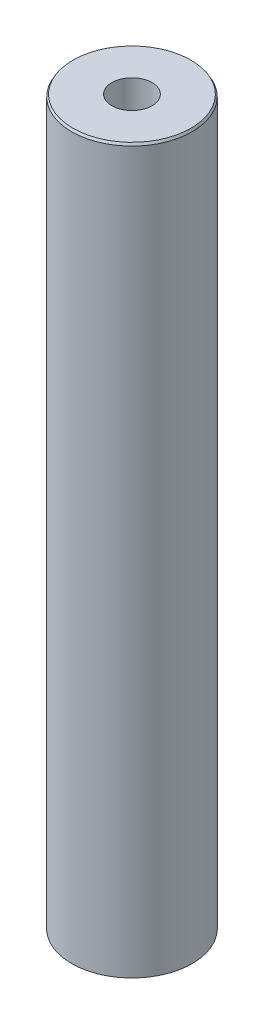
ISO-10303-21;
HEADER;
FILE_DESCRIPTION(('STEP AP214'),'2;1');
FILE_NAME('part.step','',(''),(''),'','','');
FILE_SCHEMA(('AUTOMOTIVE_DESIGN { 1 0 10303 214 1 1 1 1 }'));
ENDSEC;
DATA;
#1=APPLICATION_CONTEXT('core data for automotive mechanical design processes');
#2=APPLICATION_PROTOCOL_DEFINITION('international standard','automotive_design',2000,#1);
#3=PRODUCT_CONTEXT('',#1,'mechanical');
#4=PRODUCT('Part','Part','',(#3));
#5=PRODUCT_RELATED_PRODUCT_CATEGORY('part','',(#4));
#6=PRODUCT_DEFINITION_FORMATION('','',#4);
#7=PRODUCT_DEFINITION_CONTEXT('part definition',#1,'design');
#8=PRODUCT_DEFINITION('design','',#6,#7);
#9=PRODUCT_DEFINITION_SHAPE('','',#8);
#10=(LENGTH_UNIT() NAMED_UNIT(*) SI_UNIT(.MILLI.,.METRE.));
#11=(NAMED_UNIT(*) PLANE_ANGLE_UNIT() SI_UNIT($,.RADIAN.));
#12=(NAMED_UNIT(*) SI_UNIT($,.STERADIAN.) SOLID_ANGLE_UNIT());
#13=UNCERTAINTY_MEASURE_WITH_UNIT(LENGTH_MEASURE(1.E-05),#10,'distance_accuracy_value','');
#14=(GEOMETRIC_REPRESENTATION_CONTEXT(3) GLOBAL_UNCERTAINTY_ASSIGNED_CONTEXT((#13)) GLOBAL_UNIT_ASSIGNED_CONTEXT((#10,
#11,#12)) REPRESENTATION_CONTEXT('',''));
#15=CARTESIAN_POINT('',(0.,0.,0.));
#16=DIRECTION('',(0.,0.,1.));
#17=DIRECTION('',(1.,0.,0.));
#18=AXIS2_PLACEMENT_3D('',#15,#16,#17);
#19=CARTESIAN_POINT('',(0.,600.,0.));
#20=DIRECTION('',(0.,-1.,0.));
#21=DIRECTION('',(0.,0.,-1.));
#22=AXIS2_PLACEMENT_3D('',#19,#20,#21);
#23=CYLINDRICAL_SURFACE('',#22,50.);
#24=CARTESIAN_POINT('',(0.,598.070283497979,0.));
#25=DIRECTION('',(0.,1.,0.));
#26=DIRECTION('',(0.,0.,1.));
#27=AXIS2_PLACEMENT_3D('',#24,#25,#26);
#28=CIRCLE('',#27,50.);
#29=CARTESIAN_POINT('',(0.,598.070283497979,50.));
#30=VERTEX_POINT('',#29);
#31=EDGE_CURVE('E50',#30,#30,#28,.F.);
#32=ORIENTED_EDGE('',*,*,#31,.T.);
#33=EDGE_LOOP('',(#32));
#34=FACE_BOUND('',#33,.T.);
#35=CARTESIAN_POINT('',(0.,1.11412234190111,0.));
#36=DIRECTION('',(0.,1.,0.));
#37=DIRECTION('',(0.,0.,1.));
#38=AXIS2_PLACEMENT_3D('',#35,#36,#37);
#39=CIRCLE('',#38,50.);
#40=CARTESIAN_POINT('',(0.,1.11412234190111,50.));
#41=VERTEX_POINT('',#40);
#42=EDGE_CURVE('E51',#41,#41,#39,.T.);
#43=ORIENTED_EDGE('',*,*,#42,.T.);
#44=EDGE_LOOP('',(#43));
#45=FACE_BOUND('',#44,.T.);
#46=ADVANCED_FACE('F39',(#34,#45),#23,.T.);
#47=CARTESIAN_POINT('',(0.,600.,0.));
#48=DIRECTION('',(0.,1.,0.));
#49=DIRECTION('',(0.,0.,1.));
#50=AXIS2_PLACEMENT_3D('',#47,#48,#49);
#51=PLANE('',#50);
#52=CARTESIAN_POINT('',(0.,600.,0.));
#53=DIRECTION('',(0.,1.,0.));
#54=DIRECTION('',(0.,0.,1.));
#55=AXIS2_PLACEMENT_3D('',#52,#53,#54);
#56=CIRCLE('',#55,48.8858776580987);
#57=CARTESIAN_POINT('',(0.,600.,48.8858776580987));
#58=VERTEX_POINT('',#57);
#59=EDGE_CURVE('E54',#58,#58,#56,.T.);
#60=ORIENTED_EDGE('',*,*,#59,.T.);
#61=EDGE_LOOP('',(#60));
#62=FACE_BOUND('',#61,.T.);
#63=CARTESIAN_POINT('',(0.,600.,0.));
#64=DIRECTION('',(0.,1.,0.));
#65=DIRECTION('',(0.,0.,1.));
#66=AXIS2_PLACEMENT_3D('',#63,#64,#65);
#67=CIRCLE('',#66,16.6505416189368);
#68=CARTESIAN_POINT('',(0.,600.,16.6505416189368));
#69=VERTEX_POINT('',#68);
#70=EDGE_CURVE('E58',#69,#69,#67,.T.);
#71=ORIENTED_EDGE('',*,*,#70,.F.);
#72=EDGE_LOOP('',(#71));
#73=FACE_BOUND('',#72,.T.);
#74=ADVANCED_FACE('F69',(#62,#73),#51,.T.);
#75=CARTESIAN_POINT('',(0.,0.,0.));
#76=DIRECTION('',(0.,1.,0.));
#77=DIRECTION('',(0.,0.,1.));
#78=AXIS2_PLACEMENT_3D('',#75,#76,#77);
#79=PLANE('',#78);
#80=CARTESIAN_POINT('',(0.,0.,0.));
#81=DIRECTION('',(0.,1.,0.));
#82=DIRECTION('',(0.,0.,1.));
#83=AXIS2_PLACEMENT_3D('',#80,#81,#82);
#84=CIRCLE('',#83,48.0702834979797);
#85=CARTESIAN_POINT('',(0.,0.,48.0702834979797));
#86=VERTEX_POINT('',#85);
#87=EDGE_CURVE('E10',#86,#86,#84,.F.);
#88=ORIENTED_EDGE('',*,*,#87,.T.);
#89=EDGE_LOOP('',(#88));
#90=FACE_BOUND('',#89,.T.);
#91=CARTESIAN_POINT('',(0.,0.,0.));
#92=DIRECTION('',(0.,1.,0.));
#93=DIRECTION('',(0.,0.,1.));
#94=AXIS2_PLACEMENT_3D('',#91,#92,#93);
#95=CIRCLE('',#94,16.6505416189368);
#96=CARTESIAN_POINT('',(0.,0.,16.6505416189368));
#97=VERTEX_POINT('',#96);
#98=EDGE_CURVE('E63',#97,#97,#95,.T.);
#99=ORIENTED_EDGE('',*,*,#98,.T.);
#100=EDGE_LOOP('',(#99));
#101=FACE_BOUND('',#100,.T.);
#102=ADVANCED_FACE('F75',(#90,#101),#79,.F.);
#103=CARTESIAN_POINT('',(0.,600.,0.));
#104=DIRECTION('',(0.,-1.,0.));
#105=DIRECTION('',(0.,0.,-1.));
#106=AXIS2_PLACEMENT_3D('',#103,#104,#105);
#107=CYLINDRICAL_SURFACE('',#106,16.6505416189368);
#108=ORIENTED_EDGE('',*,*,#70,.T.);
#109=EDGE_LOOP('',(#108));
#110=FACE_BOUND('',#109,.T.);
#111=ORIENTED_EDGE('',*,*,#98,.F.);
#112=EDGE_LOOP('',(#111));
#113=FACE_BOUND('',#112,.T.);
#114=ADVANCED_FACE('F70',(#110,#113),#107,.F.);
#115=CARTESIAN_POINT('',(0.,600.,0.));
#116=DIRECTION('',(0.,-1.,0.));
#117=DIRECTION('',(0.,0.,-1.));
#118=AXIS2_PLACEMENT_3D('',#115,#116,#117);
#119=CONICAL_SURFACE('',#118,48.8858776580987,0.523598775598272);
#120=ORIENTED_EDGE('',*,*,#31,.F.);
#121=EDGE_LOOP('',(#120));
#122=FACE_BOUND('',#121,.T.);
#123=ORIENTED_EDGE('',*,*,#59,.F.);
#124=EDGE_LOOP('',(#123));
#125=FACE_BOUND('',#124,.T.);
#126=ADVANCED_FACE('F81',(#122,#125),#119,.T.);
#127=CARTESIAN_POINT('',(0.,1.11412234190111,0.));
#128=DIRECTION('',(0.,1.,0.));
#129=DIRECTION('',(0.,0.,1.));
#130=AXIS2_PLACEMENT_3D('',#127,#128,#129);
#131=CONICAL_SURFACE('',#130,50.,1.0471975511966);
#132=ORIENTED_EDGE('',*,*,#87,.F.);
#133=EDGE_LOOP('',(#132));
#134=FACE_BOUND('',#133,.T.);
#135=ORIENTED_EDGE('',*,*,#42,.F.);
#136=EDGE_LOOP('',(#135));
#137=FACE_BOUND('',#136,.T.);
#138=ADVANCED_FACE('F45',(#134,#137),#131,.T.);
#139=CLOSED_SHELL('',(#46,#74,#102,#114,#126,#138));
#140=MANIFOLD_SOLID_BREP('B2',#139);
#141=ADVANCED_BREP_SHAPE_REPRESENTATION('',(#18,#140),#14);
#142=SHAPE_DEFINITION_REPRESENTATION(#9,#141);
ENDSEC;
END-ISO-10303-21;
